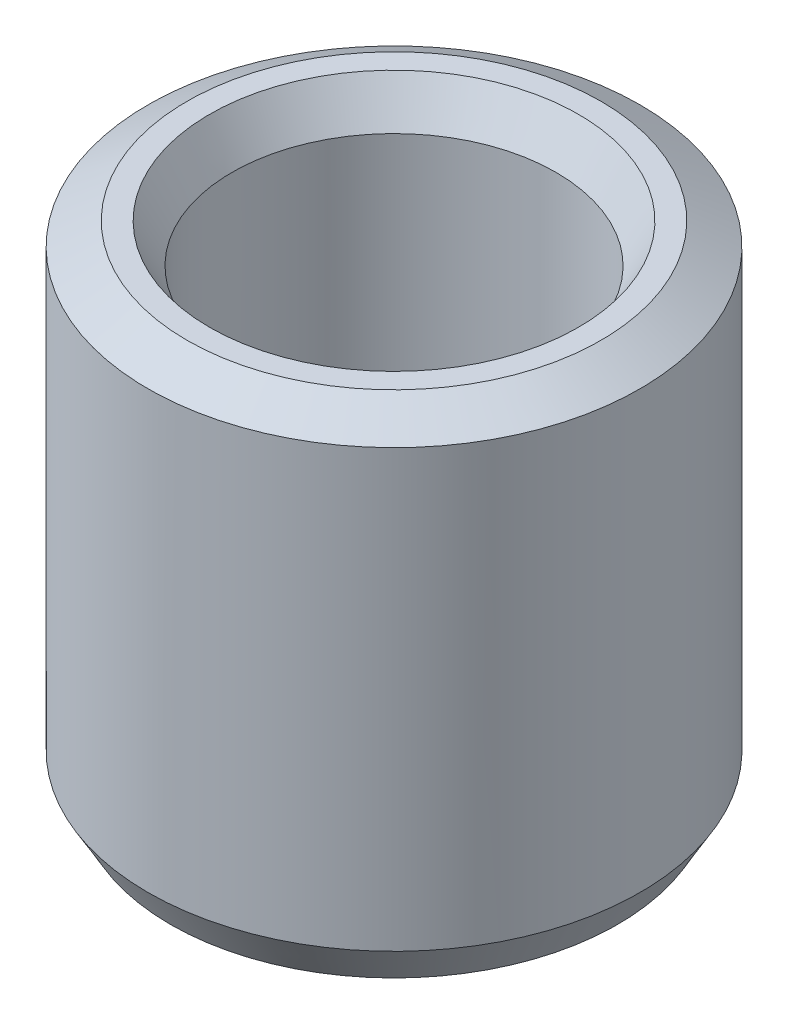
ISO-10303-21;
HEADER;
FILE_DESCRIPTION(('STEP AP214'),'2;1');
FILE_NAME('part.step','',(''),(''),'','','');
FILE_SCHEMA(('AUTOMOTIVE_DESIGN { 1 0 10303 214 1 1 1 1 }'));
ENDSEC;
DATA;
#1=APPLICATION_CONTEXT('core data for automotive mechanical design processes');
#2=APPLICATION_PROTOCOL_DEFINITION('international standard','automotive_design',2000,#1);
#3=PRODUCT_CONTEXT('',#1,'mechanical');
#4=PRODUCT('Part','Part','',(#3));
#5=PRODUCT_RELATED_PRODUCT_CATEGORY('part','',(#4));
#6=PRODUCT_DEFINITION_FORMATION('','',#4);
#7=PRODUCT_DEFINITION_CONTEXT('part definition',#1,'design');
#8=PRODUCT_DEFINITION('design','',#6,#7);
#9=PRODUCT_DEFINITION_SHAPE('','',#8);
#10=(LENGTH_UNIT() NAMED_UNIT(*) SI_UNIT(.MILLI.,.METRE.));
#11=(NAMED_UNIT(*) PLANE_ANGLE_UNIT() SI_UNIT($,.RADIAN.));
#12=(NAMED_UNIT(*) SI_UNIT($,.STERADIAN.) SOLID_ANGLE_UNIT());
#13=UNCERTAINTY_MEASURE_WITH_UNIT(LENGTH_MEASURE(1.E-05),#10,'distance_accuracy_value','');
#14=(GEOMETRIC_REPRESENTATION_CONTEXT(3) GLOBAL_UNCERTAINTY_ASSIGNED_CONTEXT((#13)) GLOBAL_UNIT_ASSIGNED_CONTEXT((#10,
#11,#12)) REPRESENTATION_CONTEXT('',''));
#15=CARTESIAN_POINT('',(0.,0.,0.));
#16=DIRECTION('',(0.,0.,1.));
#17=DIRECTION('',(1.,0.,0.));
#18=AXIS2_PLACEMENT_3D('',#15,#16,#17);
#19=CARTESIAN_POINT('',(0.,20.231477031318,0.));
#20=DIRECTION('',(0.,-1.,0.));
#21=DIRECTION('',(0.,0.,-1.));
#22=AXIS2_PLACEMENT_3D('',#19,#20,#21);
#23=CYLINDRICAL_SURFACE('',#22,10.);
#24=CARTESIAN_POINT('',(0.,1.58500320659864,0.));
#25=DIRECTION('',(0.,1.,0.));
#26=DIRECTION('',(0.,0.,1.));
#27=AXIS2_PLACEMENT_3D('',#24,#25,#26);
#28=CIRCLE('',#27,10.);
#29=CARTESIAN_POINT('',(0.,1.58500320659864,-10.));
#30=VERTEX_POINT('',#29);
#31=EDGE_CURVE('E10',#30,#30,#28,.T.);
#32=CARTESIAN_POINT('',(0.,19.3163750033219,0.));
#33=DIRECTION('',(0.,1.,0.));
#34=DIRECTION('',(0.,0.,1.));
#35=AXIS2_PLACEMENT_3D('',#32,#33,#34);
#36=CIRCLE('',#35,10.);
#37=CARTESIAN_POINT('',(0.,19.3163750033219,-10.));
#38=VERTEX_POINT('',#37);
#39=EDGE_CURVE('E50',#38,#38,#36,.F.);
#40=CARTESIAN_POINT('',(0.,1.58500320659864,-10.));
#41=CARTESIAN_POINT('',(0.,1.76970499614784,-10.));
#42=CARTESIAN_POINT('',(0.,1.95440678569704,-10.));
#43=CARTESIAN_POINT('',(0.,2.32381036479544,-10.));
#44=CARTESIAN_POINT('',(0.,2.50851215434465,-10.));
#45=CARTESIAN_POINT('',(0.,2.87791573344305,-10.));
#46=CARTESIAN_POINT('',(0.,3.06261752299225,-10.));
#47=CARTESIAN_POINT('',(0.,3.43202110209065,-10.));
#48=CARTESIAN_POINT('',(0.,3.61672289163985,-10.));
#49=CARTESIAN_POINT('',(0.,3.98612647073825,-10.));
#50=CARTESIAN_POINT('',(0.,4.17082826028745,-10.));
#51=CARTESIAN_POINT('',(0.,4.54023183938585,-10.));
#52=CARTESIAN_POINT('',(0.,4.72493362893505,-10.));
#53=CARTESIAN_POINT('',(0.,5.09433720803345,-10.));
#54=CARTESIAN_POINT('',(0.,5.27903899758266,-10.));
#55=CARTESIAN_POINT('',(0.,5.64844257668106,-10.));
#56=CARTESIAN_POINT('',(0.,5.83314436623026,-10.));
#57=CARTESIAN_POINT('',(0.,6.20254794532866,-10.));
#58=CARTESIAN_POINT('',(0.,6.38724973487786,-10.));
#59=CARTESIAN_POINT('',(0.,6.75665331397626,-10.));
#60=CARTESIAN_POINT('',(0.,6.94135510352546,-10.));
#61=CARTESIAN_POINT('',(0.,7.31075868262386,-10.));
#62=CARTESIAN_POINT('',(0.,7.49546047217307,-10.));
#63=CARTESIAN_POINT('',(0.,7.86486405127147,-10.));
#64=CARTESIAN_POINT('',(0.,8.04956584082067,-10.));
#65=CARTESIAN_POINT('',(0.,8.41896941991907,-10.));
#66=CARTESIAN_POINT('',(0.,8.60367120946827,-10.));
#67=CARTESIAN_POINT('',(0.,8.97307478856667,-10.));
#68=CARTESIAN_POINT('',(0.,9.15777657811587,-10.));
#69=CARTESIAN_POINT('',(0.,9.52718015721427,-10.));
#70=CARTESIAN_POINT('',(0.,9.71188194676347,-10.));
#71=CARTESIAN_POINT('',(0.,10.0812855258619,-10.));
#72=CARTESIAN_POINT('',(0.,10.2659873154111,-10.));
#73=CARTESIAN_POINT('',(0.,10.6353908945095,-10.));
#74=CARTESIAN_POINT('',(0.,10.8200926840587,-10.));
#75=CARTESIAN_POINT('',(0.,11.1894962631571,-10.));
#76=CARTESIAN_POINT('',(0.,11.3741980527063,-10.));
#77=CARTESIAN_POINT('',(0.,11.7436016318047,-10.));
#78=CARTESIAN_POINT('',(0.,11.9283034213539,-10.));
#79=CARTESIAN_POINT('',(0.,12.2977070004523,-10.));
#80=CARTESIAN_POINT('',(0.,12.4824087900015,-10.));
#81=CARTESIAN_POINT('',(0.,12.8518123690999,-10.));
#82=CARTESIAN_POINT('',(0.,13.0365141586491,-10.));
#83=CARTESIAN_POINT('',(0.,13.4059177377475,-10.));
#84=CARTESIAN_POINT('',(0.,13.5906195272967,-10.));
#85=CARTESIAN_POINT('',(0.,13.9600231063951,-10.));
#86=CARTESIAN_POINT('',(0.,14.1447248959443,-10.));
#87=CARTESIAN_POINT('',(0.,14.5141284750427,-10.));
#88=CARTESIAN_POINT('',(0.,14.6988302645919,-10.));
#89=CARTESIAN_POINT('',(0.,15.0682338436903,-10.));
#90=CARTESIAN_POINT('',(0.,15.2529356332395,-10.));
#91=CARTESIAN_POINT('',(0.,15.6223392123379,-10.));
#92=CARTESIAN_POINT('',(0.,15.8070410018871,-10.));
#93=CARTESIAN_POINT('',(0.,16.1764445809855,-10.));
#94=CARTESIAN_POINT('',(0.,16.3611463705347,-10.));
#95=CARTESIAN_POINT('',(0.,16.7305499496331,-10.));
#96=CARTESIAN_POINT('',(0.,16.9152517391823,-10.));
#97=CARTESIAN_POINT('',(0.,17.2846553182807,-10.));
#98=CARTESIAN_POINT('',(0.,17.4693571078299,-10.));
#99=CARTESIAN_POINT('',(0.,17.8387606869283,-10.));
#100=CARTESIAN_POINT('',(0.,18.0234624764775,-10.));
#101=CARTESIAN_POINT('',(0.,18.3928660555759,-10.));
#102=CARTESIAN_POINT('',(0.,18.5775678451251,-10.));
#103=CARTESIAN_POINT('',(0.,18.9469714242235,-10.));
#104=CARTESIAN_POINT('',(0.,19.1316732137727,-10.));
#105=CARTESIAN_POINT('',(0.,19.3163750033219,-10.));
#106=B_SPLINE_CURVE_WITH_KNOTS('',3,(#40,#41,#42,#43,#44,#45,#46,#47,#48,#49,#50,#51,#52,#53,
#54,#55,#56,#57,#58,#59,#60,#61,#62,#63,#64,#65,#66,#67,#68,#69,#70,#71,#72,#73,#74,#75,#76,#77,
#78,#79,#80,#81,#82,#83,#84,#85,#86,#87,#88,#89,#90,#91,#92,#93,#94,#95,#96,#97,#98,#99,#100,
#101,#102,#103,#104,#105),.UNSPECIFIED.,.F.,.F.,(4,2,2,2,2,2,2,2,2,2,2,2,2,2,2,2,2,2,2,2,2,2,2,
2,2,2,2,2,2,2,2,2,4),(0.,0.554105368647601,1.10821073729521,1.66231610594281,2.21642147459041,
2.77052684323801,3.32463221188561,3.87873758053321,4.43284294918082,4.98694831782842,
5.54105368647602,6.09515905512362,6.64926442377123,7.20336979241883,7.75747516106643,
8.31158052971403,8.86568589836163,9.41979126700924,9.97389663565684,10.5280020043044,
11.082107372952,11.6362127415996,12.1903181102472,12.7444234788948,13.2985288475425,
13.8526342161901,14.4067395848377,14.9608449534853,15.5149503221329,16.0690556907805,
16.6231610594281,17.1772664280757,17.7313717967233),.UNSPECIFIED.);
#107=EDGE_CURVE('BSEAM39',#30,#38,#106,.T.);
#108=ORIENTED_EDGE('',*,*,#31,.T.);
#109=ORIENTED_EDGE('',*,*,#39,.T.);
#110=ORIENTED_EDGE('',*,*,#107,.T.);
#111=ORIENTED_EDGE('',*,*,#107,.F.);
#112=EDGE_LOOP('',(#108,#110,#109,#111));
#113=FACE_BOUND('',#112,.T.);
#114=ADVANCED_FACE('F39',(#113),#23,.T.);
#115=CARTESIAN_POINT('',(0.,20.231477031318,0.));
#116=DIRECTION('',(0.,1.,0.));
#117=DIRECTION('',(0.,0.,1.));
#118=AXIS2_PLACEMENT_3D('',#115,#116,#117);
#119=PLANE('',#118);
#120=CARTESIAN_POINT('',(0.,20.231477031318,0.));
#121=DIRECTION('',(0.,1.,0.));
#122=DIRECTION('',(0.,0.,1.));
#123=AXIS2_PLACEMENT_3D('',#120,#121,#122);
#124=CIRCLE('',#123,7.49919982930937);
#125=CARTESIAN_POINT('',(0.,20.231477031318,7.49919982930937));
#126=VERTEX_POINT('',#125);
#127=EDGE_CURVE('E58',#126,#126,#124,.F.);
#128=ORIENTED_EDGE('',*,*,#127,.T.);
#129=EDGE_LOOP('',(#128));
#130=FACE_BOUND('',#129,.T.);
#131=CARTESIAN_POINT('',(0.,20.231477031318,0.));
#132=DIRECTION('',(0.,1.,0.));
#133=DIRECTION('',(0.,0.,1.));
#134=AXIS2_PLACEMENT_3D('',#131,#132,#133);
#135=CIRCLE('',#134,8.4149967934014);
#136=CARTESIAN_POINT('',(0.,20.231477031318,8.4149967934014));
#137=VERTEX_POINT('',#136);
#138=EDGE_CURVE('E61',#137,#137,#135,.T.);
#139=ORIENTED_EDGE('',*,*,#138,.T.);
#140=EDGE_LOOP('',(#139));
#141=FACE_BOUND('',#140,.T.);
#142=ADVANCED_FACE('F88',(#130,#141),#119,.T.);
#143=CARTESIAN_POINT('',(0.,0.,0.));
#144=DIRECTION('',(0.,1.,0.));
#145=DIRECTION('',(0.,0.,1.));
#146=AXIS2_PLACEMENT_3D('',#143,#144,#145);
#147=PLANE('',#146);
#148=CARTESIAN_POINT('',(0.,0.,0.));
#149=DIRECTION('',(0.,1.,0.));
#150=DIRECTION('',(0.,0.,1.));
#151=AXIS2_PLACEMENT_3D('',#148,#149,#150);
#152=CIRCLE('',#151,8.16910100791182);
#153=CARTESIAN_POINT('',(0.,0.,8.16910100791182));
#154=VERTEX_POINT('',#153);
#155=EDGE_CURVE('E51',#154,#154,#152,.T.);
#156=ORIENTED_EDGE('',*,*,#155,.T.);
#157=EDGE_LOOP('',(#156));
#158=FACE_BOUND('',#157,.T.);
#159=CARTESIAN_POINT('',(0.,0.,0.));
#160=DIRECTION('',(0.,1.,0.));
#161=DIRECTION('',(0.,0.,1.));
#162=AXIS2_PLACEMENT_3D('',#159,#160,#161);
#163=CIRCLE('',#162,9.08489797200385);
#164=CARTESIAN_POINT('',(0.,0.,9.08489797200385));
#165=VERTEX_POINT('',#164);
#166=EDGE_CURVE('E54',#165,#165,#163,.F.);
#167=ORIENTED_EDGE('',*,*,#166,.T.);
#168=EDGE_LOOP('',(#167));
#169=FACE_BOUND('',#168,.T.);
#170=ADVANCED_FACE('F83',(#158,#169),#147,.F.);
#171=CARTESIAN_POINT('',(0.,20.231477031318,0.));
#172=DIRECTION('',(0.,-1.,0.));
#173=DIRECTION('',(0.,0.,-1.));
#174=AXIS2_PLACEMENT_3D('',#171,#172,#173);
#175=CYLINDRICAL_SURFACE('',#174,6.58409780131322);
#176=CARTESIAN_POINT('',(0.,18.6464738247194,0.));
#177=DIRECTION('',(0.,1.,0.));
#178=DIRECTION('',(0.,0.,1.));
#179=AXIS2_PLACEMENT_3D('',#176,#177,#178);
#180=CIRCLE('',#179,6.58409780131322);
#181=CARTESIAN_POINT('',(0.,18.6464738247194,-6.58409780131322));
#182=VERTEX_POINT('',#181);
#183=EDGE_CURVE('E67',#182,#182,#180,.T.);
#184=CARTESIAN_POINT('',(0.,0.915102027996134,0.));
#185=DIRECTION('',(0.,1.,0.));
#186=DIRECTION('',(0.,0.,1.));
#187=AXIS2_PLACEMENT_3D('',#184,#185,#186);
#188=CIRCLE('',#187,6.58409780131322);
#189=CARTESIAN_POINT('',(0.,0.915102027996134,-6.58409780131322));
#190=VERTEX_POINT('',#189);
#191=EDGE_CURVE('E69',#190,#190,#188,.F.);
#192=CARTESIAN_POINT('',(0.,18.6464738247194,-6.58409780131322));
#193=CARTESIAN_POINT('',(0.,18.4617720351702,-6.58409780131322));
#194=CARTESIAN_POINT('',(0.,18.277070245621,-6.58409780131322));
#195=CARTESIAN_POINT('',(0.,17.9076666665226,-6.58409780131322));
#196=CARTESIAN_POINT('',(0.,17.7229648769734,-6.58409780131322));
#197=CARTESIAN_POINT('',(0.,17.353561297875,-6.58409780131322));
#198=CARTESIAN_POINT('',(0.,17.1688595083258,-6.58409780131322));
#199=CARTESIAN_POINT('',(0.,16.7994559292274,-6.58409780131322));
#200=CARTESIAN_POINT('',(0.,16.6147541396782,-6.58409780131322));
#201=CARTESIAN_POINT('',(0.,16.2453505605798,-6.58409780131322));
#202=CARTESIAN_POINT('',(0.,16.0606487710306,-6.58409780131322));
#203=CARTESIAN_POINT('',(0.,15.6912451919322,-6.58409780131322));
#204=CARTESIAN_POINT('',(0.,15.506543402383,-6.58409780131322));
#205=CARTESIAN_POINT('',(0.,15.1371398232846,-6.58409780131322));
#206=CARTESIAN_POINT('',(0.,14.9524380337354,-6.58409780131322));
#207=CARTESIAN_POINT('',(0.,14.583034454637,-6.58409780131322));
#208=CARTESIAN_POINT('',(0.,14.3983326650878,-6.58409780131322));
#209=CARTESIAN_POINT('',(0.,14.0289290859894,-6.58409780131322));
#210=CARTESIAN_POINT('',(0.,13.8442272964402,-6.58409780131322));
#211=CARTESIAN_POINT('',(0.,13.4748237173418,-6.58409780131322));
#212=CARTESIAN_POINT('',(0.,13.2901219277926,-6.58409780131322));
#213=CARTESIAN_POINT('',(0.,12.9207183486942,-6.58409780131322));
#214=CARTESIAN_POINT('',(0.,12.736016559145,-6.58409780131322));
#215=CARTESIAN_POINT('',(0.,12.3666129800466,-6.58409780131322));
#216=CARTESIAN_POINT('',(0.,12.1819111904974,-6.58409780131322));
#217=CARTESIAN_POINT('',(0.,11.812507611399,-6.58409780131322));
#218=CARTESIAN_POINT('',(0.,11.6278058218498,-6.58409780131322));
#219=CARTESIAN_POINT('',(0.,11.2584022427514,-6.58409780131322));
#220=CARTESIAN_POINT('',(0.,11.0737004532022,-6.58409780131322));
#221=CARTESIAN_POINT('',(0.,10.7042968741038,-6.58409780131322));
#222=CARTESIAN_POINT('',(0.,10.5195950845546,-6.58409780131322));
#223=CARTESIAN_POINT('',(0.,10.1501915054562,-6.58409780131322));
#224=CARTESIAN_POINT('',(0.,9.96548971590697,-6.58409780131322));
#225=CARTESIAN_POINT('',(0.,9.59608613680857,-6.58409780131322));
#226=CARTESIAN_POINT('',(0.,9.41138434725937,-6.58409780131322));
#227=CARTESIAN_POINT('',(0.,9.04198076816096,-6.58409780131322));
#228=CARTESIAN_POINT('',(0.,8.85727897861176,-6.58409780131322));
#229=CARTESIAN_POINT('',(0.,8.48787539951336,-6.58409780131322));
#230=CARTESIAN_POINT('',(0.,8.30317360996416,-6.58409780131322));
#231=CARTESIAN_POINT('',(0.,7.93377003086576,-6.58409780131322));
#232=CARTESIAN_POINT('',(0.,7.74906824131656,-6.58409780131322));
#233=CARTESIAN_POINT('',(0.,7.37966466221816,-6.58409780131322));
#234=CARTESIAN_POINT('',(0.,7.19496287266896,-6.58409780131322));
#235=CARTESIAN_POINT('',(0.,6.82555929357056,-6.58409780131322));
#236=CARTESIAN_POINT('',(0.,6.64085750402136,-6.58409780131322));
#237=CARTESIAN_POINT('',(0.,6.27145392492295,-6.58409780131322));
#238=CARTESIAN_POINT('',(0.,6.08675213537375,-6.58409780131322));
#239=CARTESIAN_POINT('',(0.,5.71734855627535,-6.58409780131322));
#240=CARTESIAN_POINT('',(0.,5.53264676672615,-6.58409780131322));
#241=CARTESIAN_POINT('',(0.,5.16324318762775,-6.58409780131322));
#242=CARTESIAN_POINT('',(0.,4.97854139807855,-6.58409780131322));
#243=CARTESIAN_POINT('',(0.,4.60913781898015,-6.58409780131322));
#244=CARTESIAN_POINT('',(0.,4.42443602943095,-6.58409780131322));
#245=CARTESIAN_POINT('',(0.,4.05503245033255,-6.58409780131322));
#246=CARTESIAN_POINT('',(0.,3.87033066078334,-6.58409780131322));
#247=CARTESIAN_POINT('',(0.,3.50092708168494,-6.58409780131322));
#248=CARTESIAN_POINT('',(0.,3.31622529213574,-6.58409780131322));
#249=CARTESIAN_POINT('',(0.,2.94682171303734,-6.58409780131322));
#250=CARTESIAN_POINT('',(0.,2.76211992348814,-6.58409780131322));
#251=CARTESIAN_POINT('',(0.,2.39271634438974,-6.58409780131322));
#252=CARTESIAN_POINT('',(0.,2.20801455484054,-6.58409780131322));
#253=CARTESIAN_POINT('',(0.,1.83861097574214,-6.58409780131322));
#254=CARTESIAN_POINT('',(0.,1.65390918619294,-6.58409780131322));
#255=CARTESIAN_POINT('',(0.,1.28450560709454,-6.58409780131322));
#256=CARTESIAN_POINT('',(0.,1.09980381754533,-6.58409780131322));
#257=CARTESIAN_POINT('',(0.,0.915102027996134,-6.58409780131322));
#258=B_SPLINE_CURVE_WITH_KNOTS('',3,(#192,#193,#194,#195,#196,#197,#198,#199,#200,#201,#202,
#203,#204,#205,#206,#207,#208,#209,#210,#211,#212,#213,#214,#215,#216,#217,#218,#219,#220,#221,
#222,#223,#224,#225,#226,#227,#228,#229,#230,#231,#232,#233,#234,#235,#236,#237,#238,#239,#240,
#241,#242,#243,#244,#245,#246,#247,#248,#249,#250,#251,#252,#253,#254,#255,#256,#257),
.UNSPECIFIED.,.F.,.F.,(4,2,2,2,2,2,2,2,2,2,2,2,2,2,2,2,2,2,2,2,2,2,2,2,2,2,2,2,2,2,2,2,4),(0.,
0.554105368647601,1.1082107372952,1.6623161059428,2.21642147459041,2.77052684323801,
3.32463221188561,3.87873758053321,4.43284294918081,4.98694831782842,5.54105368647602,
6.09515905512362,6.64926442377122,7.20336979241882,7.75747516106643,8.31158052971403,
8.86568589836163,9.41979126700923,9.97389663565683,10.5280020043044,11.082107372952,
11.6362127415996,12.1903181102472,12.7444234788948,13.2985288475424,13.85263421619,
14.4067395848376,14.9608449534853,15.5149503221329,16.0690556907805,16.6231610594281,
17.1772664280757,17.7313717967233),.UNSPECIFIED.);
#259=EDGE_CURVE('BSEAM71',#182,#190,#258,.T.);
#260=ORIENTED_EDGE('',*,*,#183,.T.);
#261=ORIENTED_EDGE('',*,*,#191,.T.);
#262=ORIENTED_EDGE('',*,*,#259,.T.);
#263=ORIENTED_EDGE('',*,*,#259,.F.);
#264=EDGE_LOOP('',(#260,#262,#261,#263));
#265=FACE_BOUND('',#264,.T.);
#266=ADVANCED_FACE('F71',(#265),#175,.F.);
#267=CARTESIAN_POINT('',(0.,18.6464738247194,0.));
#268=DIRECTION('',(0.,1.,0.));
#269=DIRECTION('',(0.,0.,1.));
#270=AXIS2_PLACEMENT_3D('',#267,#268,#269);
#271=CONICAL_SURFACE('',#270,6.58409780131322,0.523598775598304);
#272=ORIENTED_EDGE('',*,*,#127,.F.);
#273=EDGE_LOOP('',(#272));
#274=FACE_BOUND('',#273,.T.);
#275=ORIENTED_EDGE('',*,*,#183,.F.);
#276=EDGE_LOOP('',(#275));
#277=FACE_BOUND('',#276,.T.);
#278=ADVANCED_FACE('F77',(#274,#277),#271,.F.);
#279=CARTESIAN_POINT('',(0.,0.,0.));
#280=DIRECTION('',(0.,-1.,0.));
#281=DIRECTION('',(0.,0.,-1.));
#282=AXIS2_PLACEMENT_3D('',#279,#280,#281);
#283=CONICAL_SURFACE('',#282,8.16910100791182,1.04719755119659);
#284=ORIENTED_EDGE('',*,*,#191,.F.);
#285=EDGE_LOOP('',(#284));
#286=FACE_BOUND('',#285,.T.);
#287=ORIENTED_EDGE('',*,*,#155,.F.);
#288=EDGE_LOOP('',(#287));
#289=FACE_BOUND('',#288,.T.);
#290=ADVANCED_FACE('F73',(#286,#289),#283,.F.);
#291=CARTESIAN_POINT('',(0.,1.58500320659864,0.));
#292=DIRECTION('',(0.,1.,0.));
#293=DIRECTION('',(0.,0.,1.));
#294=AXIS2_PLACEMENT_3D('',#291,#292,#293);
#295=CONICAL_SURFACE('',#294,10.,0.523598775598303);
#296=ORIENTED_EDGE('',*,*,#166,.F.);
#297=EDGE_LOOP('',(#296));
#298=FACE_BOUND('',#297,.T.);
#299=ORIENTED_EDGE('',*,*,#31,.F.);
#300=EDGE_LOOP('',(#299));
#301=FACE_BOUND('',#300,.T.);
#302=ADVANCED_FACE('F76',(#298,#301),#295,.T.);
#303=CARTESIAN_POINT('',(0.,20.231477031318,0.));
#304=DIRECTION('',(0.,-1.,0.));
#305=DIRECTION('',(0.,0.,-1.));
#306=AXIS2_PLACEMENT_3D('',#303,#304,#305);
#307=CONICAL_SURFACE('',#306,8.4149967934014,1.04719755119659);
#308=ORIENTED_EDGE('',*,*,#39,.F.);
#309=EDGE_LOOP('',(#308));
#310=FACE_BOUND('',#309,.T.);
#311=ORIENTED_EDGE('',*,*,#138,.F.);
#312=EDGE_LOOP('',(#311));
#313=FACE_BOUND('',#312,.T.);
#314=ADVANCED_FACE('F45',(#310,#313),#307,.T.);
#315=CLOSED_SHELL('',(#114,#142,#170,#266,#278,#290,#302,#314));
#316=MANIFOLD_SOLID_BREP('B2',#315);
#317=ADVANCED_BREP_SHAPE_REPRESENTATION('',(#18,#316),#14);
#318=SHAPE_DEFINITION_REPRESENTATION(#9,#317);
ENDSEC;
END-ISO-10303-21;
